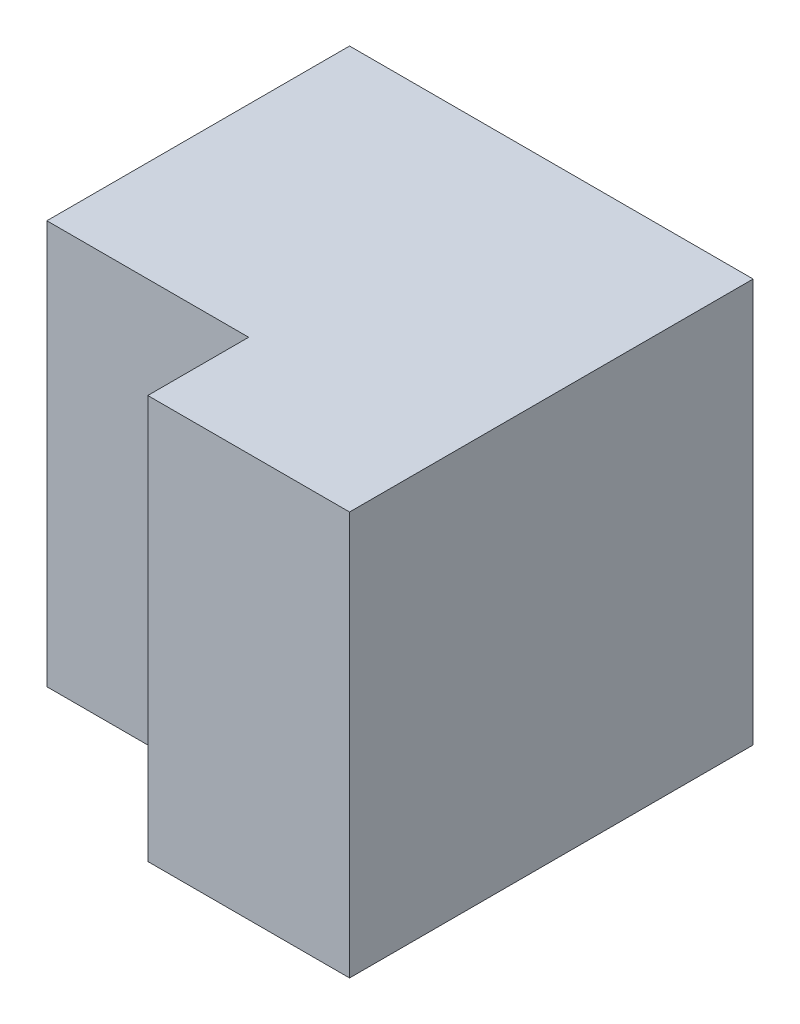
ISO-10303-21;
HEADER;
FILE_DESCRIPTION(('STEP AP214'),'2;1');
FILE_NAME('part.step','',(''),(''),'','','');
FILE_SCHEMA(('AUTOMOTIVE_DESIGN { 1 0 10303 214 1 1 1 1 }'));
ENDSEC;
DATA;
#1=APPLICATION_CONTEXT('core data for automotive mechanical design processes');
#2=APPLICATION_PROTOCOL_DEFINITION('international standard','automotive_design',2000,#1);
#3=PRODUCT_CONTEXT('',#1,'mechanical');
#4=PRODUCT('Part','Part','',(#3));
#5=PRODUCT_RELATED_PRODUCT_CATEGORY('part','',(#4));
#6=PRODUCT_DEFINITION_FORMATION('','',#4);
#7=PRODUCT_DEFINITION_CONTEXT('part definition',#1,'design');
#8=PRODUCT_DEFINITION('design','',#6,#7);
#9=PRODUCT_DEFINITION_SHAPE('','',#8);
#10=(LENGTH_UNIT() NAMED_UNIT(*) SI_UNIT(.MILLI.,.METRE.));
#11=(NAMED_UNIT(*) PLANE_ANGLE_UNIT() SI_UNIT($,.RADIAN.));
#12=(NAMED_UNIT(*) SI_UNIT($,.STERADIAN.) SOLID_ANGLE_UNIT());
#13=UNCERTAINTY_MEASURE_WITH_UNIT(LENGTH_MEASURE(1.E-05),#10,'distance_accuracy_value','');
#14=(GEOMETRIC_REPRESENTATION_CONTEXT(3) GLOBAL_UNCERTAINTY_ASSIGNED_CONTEXT((#13)) GLOBAL_UNIT_ASSIGNED_CONTEXT((#10,
#11,#12)) REPRESENTATION_CONTEXT('',''));
#15=CARTESIAN_POINT('',(0.,0.,0.));
#16=DIRECTION('',(0.,0.,1.));
#17=DIRECTION('',(1.,0.,0.));
#18=AXIS2_PLACEMENT_3D('',#15,#16,#17);
#19=CARTESIAN_POINT('',(2.,0.,0.));
#20=DIRECTION('',(0.,0.,-1.));
#21=DIRECTION('',(-1.,0.,0.));
#22=AXIS2_PLACEMENT_3D('',#19,#20,#21);
#23=PLANE('',#22);
#24=DIRECTION('',(0.,-1.,0.));
#25=VECTOR('',#24,1.);
#26=CARTESIAN_POINT('',(0.,0.,0.));
#27=LINE('',#26,#25);
#28=CARTESIAN_POINT('',(0.,4.,0.));
#29=VERTEX_POINT('',#28);
#30=CARTESIAN_POINT('',(0.,0.,0.));
#31=VERTEX_POINT('',#30);
#32=EDGE_CURVE('E115',#29,#31,#27,.T.);
#33=ORIENTED_EDGE('',*,*,#32,.T.);
#34=DIRECTION('',(-1.,0.,0.));
#35=VECTOR('',#34,1.);
#36=CARTESIAN_POINT('',(2.,0.,0.));
#37=LINE('',#36,#35);
#38=CARTESIAN_POINT('',(2.,0.,0.));
#39=VERTEX_POINT('',#38);
#40=EDGE_CURVE('E11',#39,#31,#37,.T.);
#41=ORIENTED_EDGE('',*,*,#40,.F.);
#42=DIRECTION('',(0.,-1.,0.));
#43=VECTOR('',#42,1.);
#44=CARTESIAN_POINT('',(2.,0.,0.));
#45=LINE('',#44,#43);
#46=CARTESIAN_POINT('',(2.,4.,0.));
#47=VERTEX_POINT('',#46);
#48=EDGE_CURVE('E130',#47,#39,#45,.T.);
#49=ORIENTED_EDGE('',*,*,#48,.F.);
#50=DIRECTION('',(-1.,0.,0.));
#51=VECTOR('',#50,1.);
#52=CARTESIAN_POINT('',(2.,4.,0.));
#53=LINE('',#52,#51);
#54=EDGE_CURVE('E135',#47,#29,#53,.T.);
#55=ORIENTED_EDGE('',*,*,#54,.T.);
#56=EDGE_LOOP('',(#33,#41,#49,#55));
#57=FACE_BOUND('',#56,.T.);
#58=ADVANCED_FACE('F33',(#57),#23,.F.);
#59=CARTESIAN_POINT('',(2.,0.,0.));
#60=DIRECTION('',(0.,1.,0.));
#61=DIRECTION('',(0.,0.,1.));
#62=AXIS2_PLACEMENT_3D('',#59,#60,#61);
#63=PLANE('',#62);
#64=DIRECTION('',(0.,0.,-1.));
#65=VECTOR('',#64,1.);
#66=CARTESIAN_POINT('',(0.,0.,0.));
#67=LINE('',#66,#65);
#68=CARTESIAN_POINT('',(0.,0.,-1.));
#69=VERTEX_POINT('',#68);
#70=EDGE_CURVE('E114',#31,#69,#67,.T.);
#71=ORIENTED_EDGE('',*,*,#70,.T.);
#72=DIRECTION('',(1.,0.,0.));
#73=VECTOR('',#72,1.);
#74=CARTESIAN_POINT('',(-2.,0.,-1.));
#75=LINE('',#74,#73);
#76=CARTESIAN_POINT('',(-2.,0.,-1.));
#77=VERTEX_POINT('',#76);
#78=EDGE_CURVE('E99',#77,#69,#75,.T.);
#79=ORIENTED_EDGE('',*,*,#78,.F.);
#80=DIRECTION('',(0.,0.,1.));
#81=VECTOR('',#80,1.);
#82=CARTESIAN_POINT('',(-2.,0.,-4.));
#83=LINE('',#82,#81);
#84=CARTESIAN_POINT('',(-2.,0.,-4.));
#85=VERTEX_POINT('',#84);
#86=EDGE_CURVE('E105',#85,#77,#83,.T.);
#87=ORIENTED_EDGE('',*,*,#86,.F.);
#88=DIRECTION('',(-1.,0.,0.));
#89=VECTOR('',#88,1.);
#90=CARTESIAN_POINT('',(2.,0.,-4.));
#91=LINE('',#90,#89);
#92=CARTESIAN_POINT('',(2.,0.,-4.));
#93=VERTEX_POINT('',#92);
#94=EDGE_CURVE('E41',#93,#85,#91,.T.);
#95=ORIENTED_EDGE('',*,*,#94,.F.);
#96=DIRECTION('',(0.,0.,-1.));
#97=VECTOR('',#96,1.);
#98=CARTESIAN_POINT('',(2.,0.,0.));
#99=LINE('',#98,#97);
#100=EDGE_CURVE('E78',#39,#93,#99,.T.);
#101=ORIENTED_EDGE('',*,*,#100,.F.);
#102=ORIENTED_EDGE('',*,*,#40,.T.);
#103=EDGE_LOOP('',(#71,#79,#87,#95,#101,#102));
#104=FACE_BOUND('',#103,.T.);
#105=ADVANCED_FACE('F113',(#104),#63,.F.);
#106=CARTESIAN_POINT('',(2.,0.,-4.));
#107=DIRECTION('',(0.,0.,1.));
#108=DIRECTION('',(1.,0.,0.));
#109=AXIS2_PLACEMENT_3D('',#106,#107,#108);
#110=PLANE('',#109);
#111=ORIENTED_EDGE('',*,*,#94,.T.);
#112=DIRECTION('',(0.,-1.,0.));
#113=VECTOR('',#112,1.);
#114=CARTESIAN_POINT('',(-2.,4.,-4.));
#115=LINE('',#114,#113);
#116=CARTESIAN_POINT('',(-2.,4.,-4.));
#117=VERTEX_POINT('',#116);
#118=EDGE_CURVE('E111',#117,#85,#115,.T.);
#119=ORIENTED_EDGE('',*,*,#118,.F.);
#120=DIRECTION('',(-1.,0.,0.));
#121=VECTOR('',#120,1.);
#122=CARTESIAN_POINT('',(2.,4.,-4.));
#123=LINE('',#122,#121);
#124=CARTESIAN_POINT('',(2.,4.,-4.));
#125=VERTEX_POINT('',#124);
#126=EDGE_CURVE('E142',#125,#117,#123,.T.);
#127=ORIENTED_EDGE('',*,*,#126,.F.);
#128=DIRECTION('',(0.,1.,0.));
#129=VECTOR('',#128,1.);
#130=CARTESIAN_POINT('',(2.,0.,-4.));
#131=LINE('',#130,#129);
#132=EDGE_CURVE('E133',#93,#125,#131,.T.);
#133=ORIENTED_EDGE('',*,*,#132,.F.);
#134=EDGE_LOOP('',(#111,#119,#127,#133));
#135=FACE_BOUND('',#134,.T.);
#136=ADVANCED_FACE('F151',(#135),#110,.F.);
#137=CARTESIAN_POINT('',(2.,4.,0.));
#138=DIRECTION('',(0.,-1.,0.));
#139=DIRECTION('',(0.,0.,-1.));
#140=AXIS2_PLACEMENT_3D('',#137,#138,#139);
#141=PLANE('',#140);
#142=ORIENTED_EDGE('',*,*,#126,.T.);
#143=DIRECTION('',(0.,0.,-1.));
#144=VECTOR('',#143,1.);
#145=CARTESIAN_POINT('',(-2.,4.,-1.));
#146=LINE('',#145,#144);
#147=CARTESIAN_POINT('',(-2.,4.,-1.));
#148=VERTEX_POINT('',#147);
#149=EDGE_CURVE('E104',#148,#117,#146,.T.);
#150=ORIENTED_EDGE('',*,*,#149,.F.);
#151=DIRECTION('',(1.,0.,0.));
#152=VECTOR('',#151,1.);
#153=CARTESIAN_POINT('',(-2.,4.,-1.));
#154=LINE('',#153,#152);
#155=CARTESIAN_POINT('',(0.,4.,-1.));
#156=VERTEX_POINT('',#155);
#157=EDGE_CURVE('E100',#148,#156,#154,.T.);
#158=ORIENTED_EDGE('',*,*,#157,.T.);
#159=DIRECTION('',(0.,0.,1.));
#160=VECTOR('',#159,1.);
#161=CARTESIAN_POINT('',(0.,4.,0.));
#162=LINE('',#161,#160);
#163=EDGE_CURVE('E71',#156,#29,#162,.T.);
#164=ORIENTED_EDGE('',*,*,#163,.T.);
#165=ORIENTED_EDGE('',*,*,#54,.F.);
#166=DIRECTION('',(0.,0.,1.));
#167=VECTOR('',#166,1.);
#168=CARTESIAN_POINT('',(2.,4.,0.));
#169=LINE('',#168,#167);
#170=EDGE_CURVE('E58',#125,#47,#169,.T.);
#171=ORIENTED_EDGE('',*,*,#170,.F.);
#172=EDGE_LOOP('',(#142,#150,#158,#164,#165,#171));
#173=FACE_BOUND('',#172,.T.);
#174=ADVANCED_FACE('F149',(#173),#141,.F.);
#175=CARTESIAN_POINT('',(2.,0.,0.));
#176=DIRECTION('',(-1.,0.,0.));
#177=DIRECTION('',(0.,0.,1.));
#178=AXIS2_PLACEMENT_3D('',#175,#176,#177);
#179=PLANE('',#178);
#180=ORIENTED_EDGE('',*,*,#48,.T.);
#181=ORIENTED_EDGE('',*,*,#100,.T.);
#182=ORIENTED_EDGE('',*,*,#132,.T.);
#183=ORIENTED_EDGE('',*,*,#170,.T.);
#184=EDGE_LOOP('',(#180,#181,#182,#183));
#185=FACE_BOUND('',#184,.T.);
#186=ADVANCED_FACE('F153',(#185),#179,.F.);
#187=CARTESIAN_POINT('',(0.,0.,0.));
#188=DIRECTION('',(-1.,0.,0.));
#189=DIRECTION('',(0.,0.,1.));
#190=AXIS2_PLACEMENT_3D('',#187,#188,#189);
#191=PLANE('',#190);
#192=DIRECTION('',(0.,1.,0.));
#193=VECTOR('',#192,1.);
#194=CARTESIAN_POINT('',(0.,0.,-1.));
#195=LINE('',#194,#193);
#196=EDGE_CURVE('E49',#69,#156,#195,.T.);
#197=ORIENTED_EDGE('',*,*,#196,.F.);
#198=ORIENTED_EDGE('',*,*,#70,.F.);
#199=ORIENTED_EDGE('',*,*,#32,.F.);
#200=ORIENTED_EDGE('',*,*,#163,.F.);
#201=EDGE_LOOP('',(#197,#198,#199,#200));
#202=FACE_BOUND('',#201,.T.);
#203=ADVANCED_FACE('F148',(#202),#191,.T.);
#204=CARTESIAN_POINT('',(-2.,0.,-1.));
#205=DIRECTION('',(0.,0.,-1.));
#206=DIRECTION('',(-1.,0.,0.));
#207=AXIS2_PLACEMENT_3D('',#204,#205,#206);
#208=PLANE('',#207);
#209=ORIENTED_EDGE('',*,*,#196,.T.);
#210=ORIENTED_EDGE('',*,*,#157,.F.);
#211=DIRECTION('',(0.,1.,0.));
#212=VECTOR('',#211,1.);
#213=CARTESIAN_POINT('',(-2.,0.,-1.));
#214=LINE('',#213,#212);
#215=EDGE_CURVE('E95',#77,#148,#214,.T.);
#216=ORIENTED_EDGE('',*,*,#215,.F.);
#217=ORIENTED_EDGE('',*,*,#78,.T.);
#218=EDGE_LOOP('',(#209,#210,#216,#217));
#219=FACE_BOUND('',#218,.T.);
#220=ADVANCED_FACE('F97',(#219),#208,.F.);
#221=CARTESIAN_POINT('',(-2.,0.,0.));
#222=DIRECTION('',(-1.,0.,0.));
#223=DIRECTION('',(0.,0.,1.));
#224=AXIS2_PLACEMENT_3D('',#221,#222,#223);
#225=PLANE('',#224);
#226=ORIENTED_EDGE('',*,*,#86,.T.);
#227=ORIENTED_EDGE('',*,*,#215,.T.);
#228=ORIENTED_EDGE('',*,*,#149,.T.);
#229=ORIENTED_EDGE('',*,*,#118,.T.);
#230=EDGE_LOOP('',(#226,#227,#228,#229));
#231=FACE_BOUND('',#230,.T.);
#232=ADVANCED_FACE('F109',(#231),#225,.T.);
#233=CLOSED_SHELL('',(#58,#105,#136,#174,#186,#203,#220,#232));
#234=MANIFOLD_SOLID_BREP('B2',#233);
#235=ADVANCED_BREP_SHAPE_REPRESENTATION('',(#18,#234),#14);
#236=SHAPE_DEFINITION_REPRESENTATION(#9,#235);
ENDSEC;
END-ISO-10303-21;
